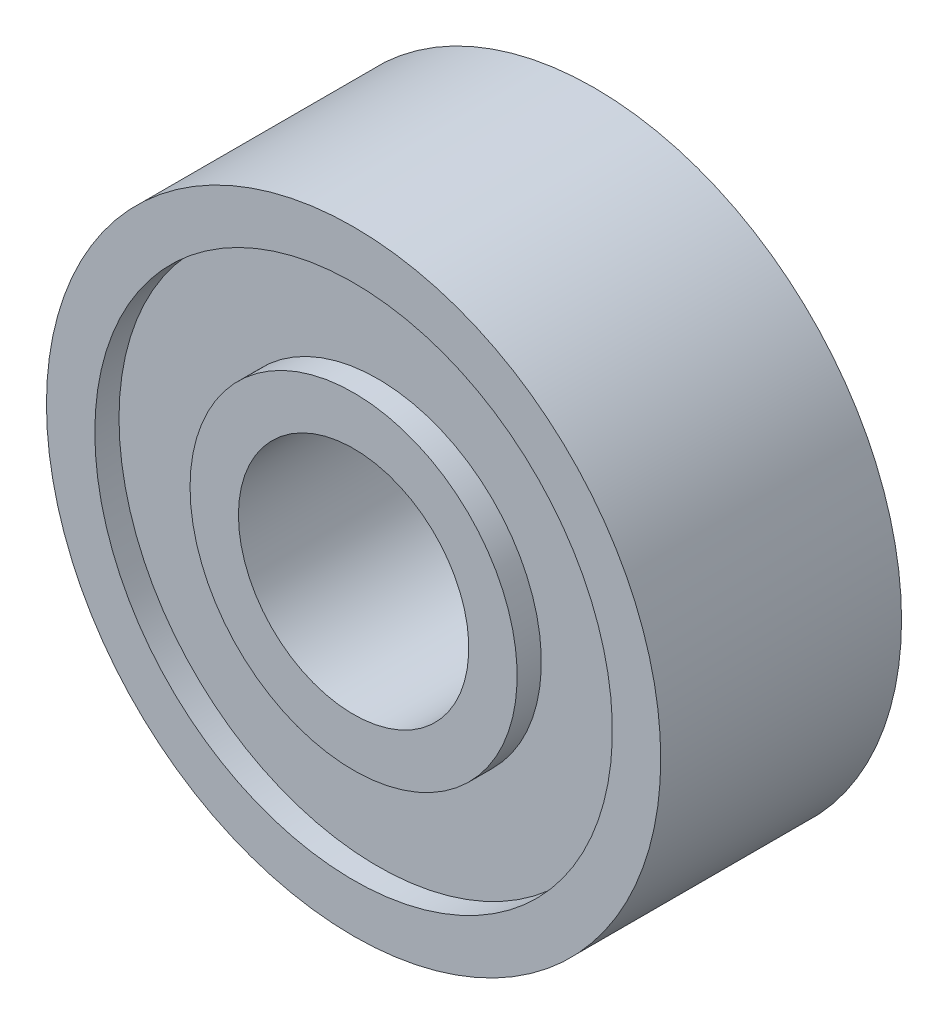
ISO-10303-21;
HEADER;
FILE_DESCRIPTION(('STEP AP214'),'2;1');
FILE_NAME('part.step','',(''),(''),'','','');
FILE_SCHEMA(('AUTOMOTIVE_DESIGN { 1 0 10303 214 1 1 1 1 }'));
ENDSEC;
DATA;
#1=APPLICATION_CONTEXT('core data for automotive mechanical design processes');
#2=APPLICATION_PROTOCOL_DEFINITION('international standard','automotive_design',2000,#1);
#3=PRODUCT_CONTEXT('',#1,'mechanical');
#4=PRODUCT('Part','Part','',(#3));
#5=PRODUCT_RELATED_PRODUCT_CATEGORY('part','',(#4));
#6=PRODUCT_DEFINITION_FORMATION('','',#4);
#7=PRODUCT_DEFINITION_CONTEXT('part definition',#1,'design');
#8=PRODUCT_DEFINITION('design','',#6,#7);
#9=PRODUCT_DEFINITION_SHAPE('','',#8);
#10=(LENGTH_UNIT() NAMED_UNIT(*) SI_UNIT(.MILLI.,.METRE.));
#11=(NAMED_UNIT(*) PLANE_ANGLE_UNIT() SI_UNIT($,.RADIAN.));
#12=(NAMED_UNIT(*) SI_UNIT($,.STERADIAN.) SOLID_ANGLE_UNIT());
#13=UNCERTAINTY_MEASURE_WITH_UNIT(LENGTH_MEASURE(1.E-05),#10,'distance_accuracy_value','');
#14=(GEOMETRIC_REPRESENTATION_CONTEXT(3) GLOBAL_UNCERTAINTY_ASSIGNED_CONTEXT((#13)) GLOBAL_UNIT_ASSIGNED_CONTEXT((#10,
#11,#12)) REPRESENTATION_CONTEXT('',''));
#15=CARTESIAN_POINT('',(0.,0.,0.));
#16=DIRECTION('',(0.,0.,1.));
#17=DIRECTION('',(1.,0.,0.));
#18=AXIS2_PLACEMENT_3D('',#15,#16,#17);
#19=CARTESIAN_POINT('',(0.,0.,-30.6024402864249));
#20=DIRECTION('',(0.,0.,-1.));
#21=DIRECTION('',(-1.,0.,0.));
#22=AXIS2_PLACEMENT_3D('',#19,#20,#21);
#23=CYLINDRICAL_SURFACE('',#22,2.38125);
#24=CARTESIAN_POINT('',(0.,0.,-2.4892));
#25=DIRECTION('',(0.,0.,-1.));
#26=DIRECTION('',(-1.,0.,0.));
#27=AXIS2_PLACEMENT_3D('',#24,#25,#26);
#28=CIRCLE('',#27,2.38125);
#29=CARTESIAN_POINT('',(-2.38125,0.,-2.4892));
#30=VERTEX_POINT('',#29);
#31=EDGE_CURVE('E51',#30,#30,#28,.F.);
#32=ORIENTED_EDGE('',*,*,#31,.F.);
#33=EDGE_LOOP('',(#32));
#34=FACE_BOUND('',#33,.T.);
#35=CARTESIAN_POINT('',(0.,0.,2.48919999999999));
#36=DIRECTION('',(0.,0.,-1.));
#37=DIRECTION('',(-1.,0.,0.));
#38=AXIS2_PLACEMENT_3D('',#35,#36,#37);
#39=CIRCLE('',#38,2.38125);
#40=CARTESIAN_POINT('',(-2.38125,0.,2.48919999999999));
#41=VERTEX_POINT('',#40);
#42=EDGE_CURVE('E17',#41,#41,#39,.T.);
#43=ORIENTED_EDGE('',*,*,#42,.F.);
#44=EDGE_LOOP('',(#43));
#45=FACE_BOUND('',#44,.T.);
#46=ADVANCED_FACE('F14',(#34,#45),#23,.F.);
#47=CARTESIAN_POINT('',(0.,2.38125,2.4892));
#48=DIRECTION('',(0.,0.,1.));
#49=DIRECTION('',(1.,0.,0.));
#50=AXIS2_PLACEMENT_3D('',#47,#48,#49);
#51=PLANE('',#50);
#52=CARTESIAN_POINT('',(0.,0.,2.48919999999999));
#53=DIRECTION('',(0.,0.,-1.));
#54=DIRECTION('',(-1.,0.,0.));
#55=AXIS2_PLACEMENT_3D('',#52,#53,#54);
#56=CIRCLE('',#55,3.38125);
#57=CARTESIAN_POINT('',(-3.38125,0.,2.48919999999999));
#58=VERTEX_POINT('',#57);
#59=EDGE_CURVE('E49',#58,#58,#56,.T.);
#60=ORIENTED_EDGE('',*,*,#59,.F.);
#61=EDGE_LOOP('',(#60));
#62=FACE_BOUND('',#61,.T.);
#63=ORIENTED_EDGE('',*,*,#42,.T.);
#64=EDGE_LOOP('',(#63));
#65=FACE_BOUND('',#64,.T.);
#66=ADVANCED_FACE('F58',(#62,#65),#51,.T.);
#67=CARTESIAN_POINT('',(0.,3.38125,-2.4892));
#68=DIRECTION('',(0.,0.,-1.));
#69=DIRECTION('',(-1.,0.,0.));
#70=AXIS2_PLACEMENT_3D('',#67,#68,#69);
#71=PLANE('',#70);
#72=ORIENTED_EDGE('',*,*,#31,.T.);
#73=EDGE_LOOP('',(#72));
#74=FACE_BOUND('',#73,.T.);
#75=CARTESIAN_POINT('',(0.,0.,-2.4892));
#76=DIRECTION('',(0.,0.,-1.));
#77=DIRECTION('',(-1.,0.,0.));
#78=AXIS2_PLACEMENT_3D('',#75,#76,#77);
#79=CIRCLE('',#78,3.38125);
#80=CARTESIAN_POINT('',(-3.38125,0.,-2.4892));
#81=VERTEX_POINT('',#80);
#82=EDGE_CURVE('E46',#81,#81,#79,.F.);
#83=ORIENTED_EDGE('',*,*,#82,.F.);
#84=EDGE_LOOP('',(#83));
#85=FACE_BOUND('',#84,.T.);
#86=ADVANCED_FACE('F66',(#74,#85),#71,.T.);
#87=CARTESIAN_POINT('',(0.,0.,-30.6024402864249));
#88=DIRECTION('',(0.,0.,-1.));
#89=DIRECTION('',(-1.,0.,0.));
#90=AXIS2_PLACEMENT_3D('',#87,#88,#89);
#91=CYLINDRICAL_SURFACE('',#90,3.38125);
#92=ORIENTED_EDGE('',*,*,#59,.T.);
#93=EDGE_LOOP('',(#92));
#94=FACE_BOUND('',#93,.T.);
#95=CARTESIAN_POINT('',(0.,0.,1.98920000000001));
#96=DIRECTION('',(0.,0.,-1.));
#97=DIRECTION('',(-1.,0.,0.));
#98=AXIS2_PLACEMENT_3D('',#95,#96,#97);
#99=CIRCLE('',#98,3.38125);
#100=CARTESIAN_POINT('',(-3.38125,0.,1.98920000000001));
#101=VERTEX_POINT('',#100);
#102=EDGE_CURVE('E43',#101,#101,#99,.T.);
#103=ORIENTED_EDGE('',*,*,#102,.F.);
#104=EDGE_LOOP('',(#103));
#105=FACE_BOUND('',#104,.T.);
#106=ADVANCED_FACE('F103',(#94,#105),#91,.T.);
#107=CARTESIAN_POINT('',(0.,0.,-30.6024402864249));
#108=DIRECTION('',(0.,0.,-1.));
#109=DIRECTION('',(-1.,0.,0.));
#110=AXIS2_PLACEMENT_3D('',#107,#108,#109);
#111=CYLINDRICAL_SURFACE('',#110,3.38125);
#112=CARTESIAN_POINT('',(0.,0.,-1.9892));
#113=DIRECTION('',(0.,0.,-1.));
#114=DIRECTION('',(-1.,0.,0.));
#115=AXIS2_PLACEMENT_3D('',#112,#113,#114);
#116=CIRCLE('',#115,3.38125);
#117=CARTESIAN_POINT('',(-3.38125,0.,-1.9892));
#118=VERTEX_POINT('',#117);
#119=EDGE_CURVE('E40',#118,#118,#116,.F.);
#120=ORIENTED_EDGE('',*,*,#119,.F.);
#121=EDGE_LOOP('',(#120));
#122=FACE_BOUND('',#121,.T.);
#123=ORIENTED_EDGE('',*,*,#82,.T.);
#124=EDGE_LOOP('',(#123));
#125=FACE_BOUND('',#124,.T.);
#126=ADVANCED_FACE('F99',(#122,#125),#111,.T.);
#127=CARTESIAN_POINT('',(0.,3.38125,1.9892));
#128=DIRECTION('',(0.,0.,1.));
#129=DIRECTION('',(1.,0.,0.));
#130=AXIS2_PLACEMENT_3D('',#127,#128,#129);
#131=PLANE('',#130);
#132=CARTESIAN_POINT('',(0.,0.,1.98919999999999));
#133=DIRECTION('',(0.,0.,-1.));
#134=DIRECTION('',(-1.,0.,0.));
#135=AXIS2_PLACEMENT_3D('',#132,#133,#134);
#136=CIRCLE('',#135,5.35);
#137=CARTESIAN_POINT('',(-5.35,0.,1.98919999999999));
#138=VERTEX_POINT('',#137);
#139=EDGE_CURVE('E37',#138,#138,#136,.F.);
#140=ORIENTED_EDGE('',*,*,#139,.T.);
#141=EDGE_LOOP('',(#140));
#142=FACE_BOUND('',#141,.T.);
#143=ORIENTED_EDGE('',*,*,#102,.T.);
#144=EDGE_LOOP('',(#143));
#145=FACE_BOUND('',#144,.T.);
#146=ADVANCED_FACE('F95',(#142,#145),#131,.T.);
#147=CARTESIAN_POINT('',(0.,5.35,-1.9892));
#148=DIRECTION('',(0.,0.,-1.));
#149=DIRECTION('',(-1.,0.,0.));
#150=AXIS2_PLACEMENT_3D('',#147,#148,#149);
#151=PLANE('',#150);
#152=ORIENTED_EDGE('',*,*,#119,.T.);
#153=EDGE_LOOP('',(#152));
#154=FACE_BOUND('',#153,.T.);
#155=CARTESIAN_POINT('',(0.,0.,-1.9892));
#156=DIRECTION('',(0.,0.,-1.));
#157=DIRECTION('',(-1.,0.,0.));
#158=AXIS2_PLACEMENT_3D('',#155,#156,#157);
#159=CIRCLE('',#158,5.35);
#160=CARTESIAN_POINT('',(-5.35,0.,-1.9892));
#161=VERTEX_POINT('',#160);
#162=EDGE_CURVE('E34',#161,#161,#159,.T.);
#163=ORIENTED_EDGE('',*,*,#162,.T.);
#164=EDGE_LOOP('',(#163));
#165=FACE_BOUND('',#164,.T.);
#166=ADVANCED_FACE('F91',(#154,#165),#151,.T.);
#167=CARTESIAN_POINT('',(0.,0.,-30.6024402864249));
#168=DIRECTION('',(0.,0.,-1.));
#169=DIRECTION('',(-1.,0.,0.));
#170=AXIS2_PLACEMENT_3D('',#167,#168,#169);
#171=CYLINDRICAL_SURFACE('',#170,5.35);
#172=ORIENTED_EDGE('',*,*,#139,.F.);
#173=EDGE_LOOP('',(#172));
#174=FACE_BOUND('',#173,.T.);
#175=CARTESIAN_POINT('',(0.,0.,2.48919999999999));
#176=DIRECTION('',(0.,0.,-1.));
#177=DIRECTION('',(-1.,0.,0.));
#178=AXIS2_PLACEMENT_3D('',#175,#176,#177);
#179=CIRCLE('',#178,5.35);
#180=CARTESIAN_POINT('',(-5.35,0.,2.48919999999999));
#181=VERTEX_POINT('',#180);
#182=EDGE_CURVE('E31',#181,#181,#179,.T.);
#183=ORIENTED_EDGE('',*,*,#182,.F.);
#184=EDGE_LOOP('',(#183));
#185=FACE_BOUND('',#184,.T.);
#186=ADVANCED_FACE('F87',(#174,#185),#171,.F.);
#187=CARTESIAN_POINT('',(0.,0.,-30.6024402864249));
#188=DIRECTION('',(0.,0.,-1.));
#189=DIRECTION('',(-1.,0.,0.));
#190=AXIS2_PLACEMENT_3D('',#187,#188,#189);
#191=CYLINDRICAL_SURFACE('',#190,5.35);
#192=CARTESIAN_POINT('',(0.,0.,-2.4892));
#193=DIRECTION('',(0.,0.,-1.));
#194=DIRECTION('',(-1.,0.,0.));
#195=AXIS2_PLACEMENT_3D('',#192,#193,#194);
#196=CIRCLE('',#195,5.35);
#197=CARTESIAN_POINT('',(-5.35,0.,-2.4892));
#198=VERTEX_POINT('',#197);
#199=EDGE_CURVE('E26',#198,#198,#196,.F.);
#200=ORIENTED_EDGE('',*,*,#199,.F.);
#201=EDGE_LOOP('',(#200));
#202=FACE_BOUND('',#201,.T.);
#203=ORIENTED_EDGE('',*,*,#162,.F.);
#204=EDGE_LOOP('',(#203));
#205=FACE_BOUND('',#204,.T.);
#206=ADVANCED_FACE('F83',(#202,#205),#191,.F.);
#207=CARTESIAN_POINT('',(0.,5.35,2.4892));
#208=DIRECTION('',(0.,0.,1.));
#209=DIRECTION('',(1.,0.,0.));
#210=AXIS2_PLACEMENT_3D('',#207,#208,#209);
#211=PLANE('',#210);
#212=CARTESIAN_POINT('',(0.,0.,2.48919999999999));
#213=DIRECTION('',(0.,0.,-1.));
#214=DIRECTION('',(-1.,0.,0.));
#215=AXIS2_PLACEMENT_3D('',#212,#213,#214);
#216=CIRCLE('',#215,6.35);
#217=CARTESIAN_POINT('',(-6.35,0.,2.48919999999999));
#218=VERTEX_POINT('',#217);
#219=EDGE_CURVE('E21',#218,#218,#216,.T.);
#220=ORIENTED_EDGE('',*,*,#219,.F.);
#221=EDGE_LOOP('',(#220));
#222=FACE_BOUND('',#221,.T.);
#223=ORIENTED_EDGE('',*,*,#182,.T.);
#224=EDGE_LOOP('',(#223));
#225=FACE_BOUND('',#224,.T.);
#226=ADVANCED_FACE('F76',(#222,#225),#211,.T.);
#227=CARTESIAN_POINT('',(0.,6.35,-2.4892));
#228=DIRECTION('',(0.,0.,-1.));
#229=DIRECTION('',(-1.,0.,0.));
#230=AXIS2_PLACEMENT_3D('',#227,#228,#229);
#231=PLANE('',#230);
#232=ORIENTED_EDGE('',*,*,#199,.T.);
#233=EDGE_LOOP('',(#232));
#234=FACE_BOUND('',#233,.T.);
#235=CARTESIAN_POINT('',(0.,0.,-2.4892));
#236=DIRECTION('',(0.,0.,-1.));
#237=DIRECTION('',(-1.,0.,0.));
#238=AXIS2_PLACEMENT_3D('',#235,#236,#237);
#239=CIRCLE('',#238,6.35);
#240=CARTESIAN_POINT('',(-6.35,0.,-2.4892));
#241=VERTEX_POINT('',#240);
#242=EDGE_CURVE('E10',#241,#241,#239,.F.);
#243=ORIENTED_EDGE('',*,*,#242,.F.);
#244=EDGE_LOOP('',(#243));
#245=FACE_BOUND('',#244,.T.);
#246=ADVANCED_FACE('F70',(#234,#245),#231,.T.);
#247=CARTESIAN_POINT('',(0.,0.,-30.6024402864249));
#248=DIRECTION('',(0.,0.,-1.));
#249=DIRECTION('',(-1.,0.,0.));
#250=AXIS2_PLACEMENT_3D('',#247,#248,#249);
#251=CYLINDRICAL_SURFACE('',#250,6.35);
#252=ORIENTED_EDGE('',*,*,#242,.T.);
#253=EDGE_LOOP('',(#252));
#254=FACE_BOUND('',#253,.T.);
#255=ORIENTED_EDGE('',*,*,#219,.T.);
#256=EDGE_LOOP('',(#255));
#257=FACE_BOUND('',#256,.T.);
#258=ADVANCED_FACE('F68',(#254,#257),#251,.T.);
#259=CLOSED_SHELL('',(#46,#66,#86,#106,#126,#146,#166,#186,#206,#226,#246,#258));
#260=MANIFOLD_SOLID_BREP('B1',#259);
#261=ADVANCED_BREP_SHAPE_REPRESENTATION('',(#18,#260),#14);
#262=SHAPE_DEFINITION_REPRESENTATION(#9,#261);
ENDSEC;
END-ISO-10303-21;
